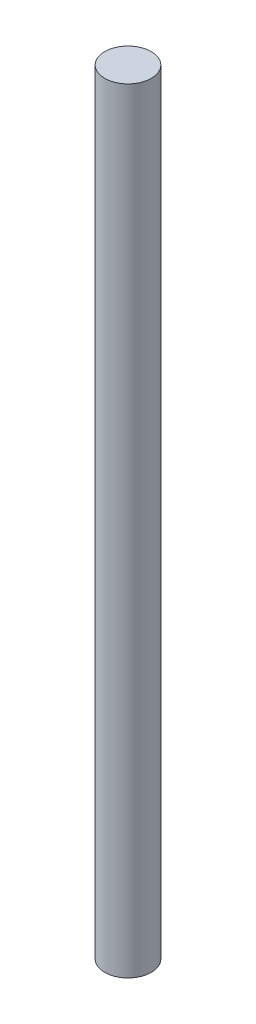
ISO-10303-21;
HEADER;
FILE_DESCRIPTION(('STEP AP214'),'2;1');
FILE_NAME('part.step','',(''),(''),'','','');
FILE_SCHEMA(('AUTOMOTIVE_DESIGN { 1 0 10303 214 1 1 1 1 }'));
ENDSEC;
DATA;
#1=APPLICATION_CONTEXT('core data for automotive mechanical design processes');
#2=APPLICATION_PROTOCOL_DEFINITION('international standard','automotive_design',2000,#1);
#3=PRODUCT_CONTEXT('',#1,'mechanical');
#4=PRODUCT('Part','Part','',(#3));
#5=PRODUCT_RELATED_PRODUCT_CATEGORY('part','',(#4));
#6=PRODUCT_DEFINITION_FORMATION('','',#4);
#7=PRODUCT_DEFINITION_CONTEXT('part definition',#1,'design');
#8=PRODUCT_DEFINITION('design','',#6,#7);
#9=PRODUCT_DEFINITION_SHAPE('','',#8);
#10=(LENGTH_UNIT() NAMED_UNIT(*) SI_UNIT(.MILLI.,.METRE.));
#11=(NAMED_UNIT(*) PLANE_ANGLE_UNIT() SI_UNIT($,.RADIAN.));
#12=(NAMED_UNIT(*) SI_UNIT($,.STERADIAN.) SOLID_ANGLE_UNIT());
#13=UNCERTAINTY_MEASURE_WITH_UNIT(LENGTH_MEASURE(1.E-05),#10,'distance_accuracy_value','');
#14=(GEOMETRIC_REPRESENTATION_CONTEXT(3) GLOBAL_UNCERTAINTY_ASSIGNED_CONTEXT((#13)) GLOBAL_UNIT_ASSIGNED_CONTEXT((#10,
#11,#12)) REPRESENTATION_CONTEXT('',''));
#15=CARTESIAN_POINT('',(0.,0.,0.));
#16=DIRECTION('',(0.,0.,1.));
#17=DIRECTION('',(1.,0.,0.));
#18=AXIS2_PLACEMENT_3D('',#15,#16,#17);
#19=CARTESIAN_POINT('',(0.,100.,0.));
#20=DIRECTION('',(0.,-1.,0.));
#21=DIRECTION('',(0.,0.,-1.));
#22=AXIS2_PLACEMENT_3D('',#19,#20,#21);
#23=CYLINDRICAL_SURFACE('',#22,3.);
#24=CARTESIAN_POINT('',(0.,100.,0.));
#25=DIRECTION('',(0.,1.,0.));
#26=DIRECTION('',(0.,0.,1.));
#27=AXIS2_PLACEMENT_3D('',#24,#25,#26);
#28=CIRCLE('',#27,3.);
#29=CARTESIAN_POINT('',(0.,100.,3.));
#30=VERTEX_POINT('',#29);
#31=EDGE_CURVE('E10',#30,#30,#28,.T.);
#32=ORIENTED_EDGE('',*,*,#31,.F.);
#33=EDGE_LOOP('',(#32));
#34=FACE_BOUND('',#33,.T.);
#35=CARTESIAN_POINT('',(0.,0.,0.));
#36=DIRECTION('',(0.,1.,0.));
#37=DIRECTION('',(0.,0.,1.));
#38=AXIS2_PLACEMENT_3D('',#35,#36,#37);
#39=CIRCLE('',#38,3.);
#40=CARTESIAN_POINT('',(0.,0.,3.));
#41=VERTEX_POINT('',#40);
#42=EDGE_CURVE('E33',#41,#41,#39,.T.);
#43=ORIENTED_EDGE('',*,*,#42,.T.);
#44=EDGE_LOOP('',(#43));
#45=FACE_BOUND('',#44,.T.);
#46=ADVANCED_FACE('F30',(#34,#45),#23,.T.);
#47=CARTESIAN_POINT('',(0.,100.,0.));
#48=DIRECTION('',(0.,1.,0.));
#49=DIRECTION('',(0.,0.,1.));
#50=AXIS2_PLACEMENT_3D('',#47,#48,#49);
#51=PLANE('',#50);
#52=ORIENTED_EDGE('',*,*,#31,.T.);
#53=EDGE_LOOP('',(#52));
#54=FACE_BOUND('',#53,.T.);
#55=ADVANCED_FACE('F45',(#54),#51,.T.);
#56=CARTESIAN_POINT('',(0.,0.,0.));
#57=DIRECTION('',(0.,1.,0.));
#58=DIRECTION('',(0.,0.,1.));
#59=AXIS2_PLACEMENT_3D('',#56,#57,#58);
#60=PLANE('',#59);
#61=ORIENTED_EDGE('',*,*,#42,.F.);
#62=EDGE_LOOP('',(#61));
#63=FACE_BOUND('',#62,.T.);
#64=ADVANCED_FACE('F43',(#63),#60,.F.);
#65=CLOSED_SHELL('',(#46,#55,#64));
#66=MANIFOLD_SOLID_BREP('B2',#65);
#67=ADVANCED_BREP_SHAPE_REPRESENTATION('',(#18,#66),#14);
#68=SHAPE_DEFINITION_REPRESENTATION(#9,#67);
ENDSEC;
END-ISO-10303-21;
